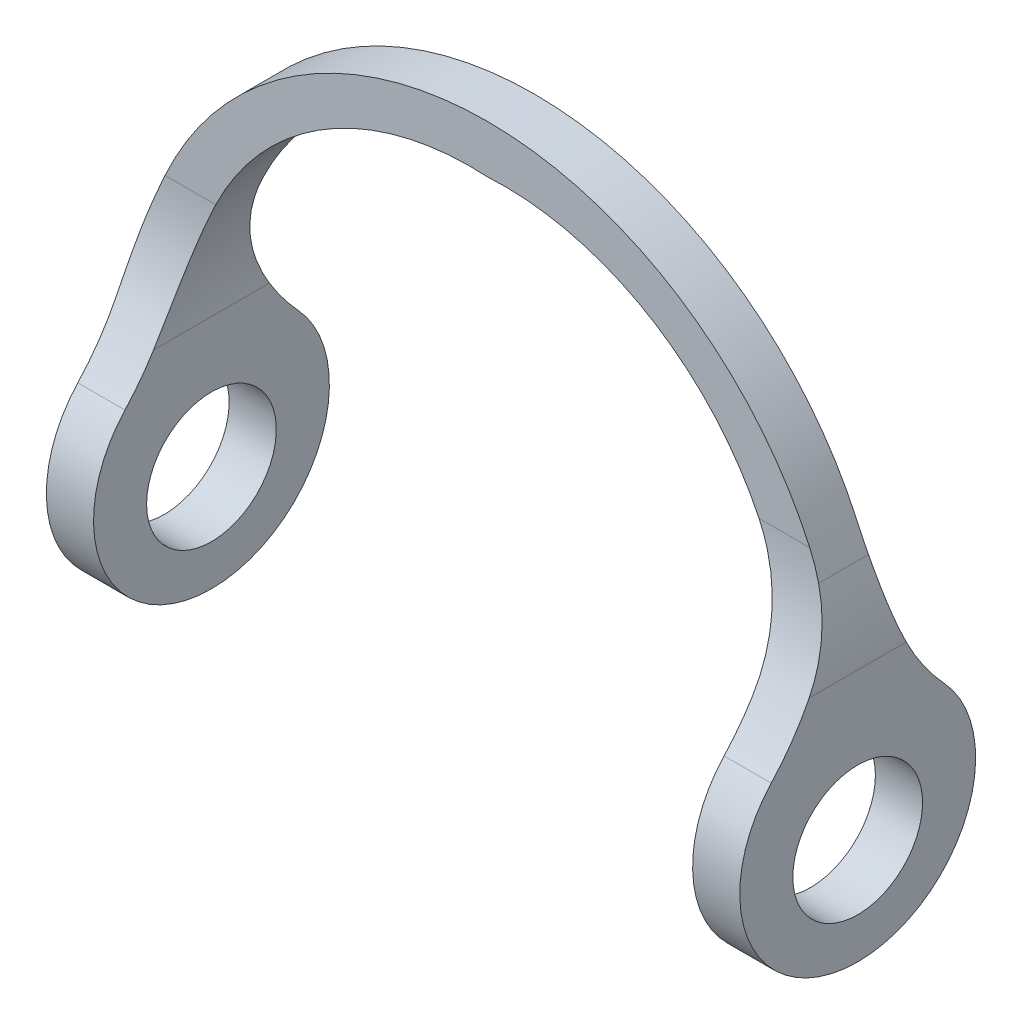
ISO-10303-21;
HEADER;
FILE_DESCRIPTION(('STEP AP214'),'2;1');
FILE_NAME('part.step','',(''),(''),'','','');
FILE_SCHEMA(('AUTOMOTIVE_DESIGN { 1 0 10303 214 1 1 1 1 }'));
ENDSEC;
DATA;
#1=APPLICATION_CONTEXT('core data for automotive mechanical design processes');
#2=APPLICATION_PROTOCOL_DEFINITION('international standard','automotive_design',2000,#1);
#3=PRODUCT_CONTEXT('',#1,'mechanical');
#4=PRODUCT('Part','Part','',(#3));
#5=PRODUCT_RELATED_PRODUCT_CATEGORY('part','',(#4));
#6=PRODUCT_DEFINITION_FORMATION('','',#4);
#7=PRODUCT_DEFINITION_CONTEXT('part definition',#1,'design');
#8=PRODUCT_DEFINITION('design','',#6,#7);
#9=PRODUCT_DEFINITION_SHAPE('','',#8);
#10=(LENGTH_UNIT() NAMED_UNIT(*) SI_UNIT(.MILLI.,.METRE.));
#11=(NAMED_UNIT(*) PLANE_ANGLE_UNIT() SI_UNIT($,.RADIAN.));
#12=(NAMED_UNIT(*) SI_UNIT($,.STERADIAN.) SOLID_ANGLE_UNIT());
#13=UNCERTAINTY_MEASURE_WITH_UNIT(LENGTH_MEASURE(1.E-05),#10,'distance_accuracy_value','');
#14=(GEOMETRIC_REPRESENTATION_CONTEXT(3) GLOBAL_UNCERTAINTY_ASSIGNED_CONTEXT((#13)) GLOBAL_UNIT_ASSIGNED_CONTEXT((#10,
#11,#12)) REPRESENTATION_CONTEXT('',''));
#15=CARTESIAN_POINT('',(0.,0.,0.));
#16=DIRECTION('',(0.,0.,1.));
#17=DIRECTION('',(1.,0.,0.));
#18=AXIS2_PLACEMENT_3D('',#15,#16,#17);
#19=CARTESIAN_POINT('',(0.,2.03547175330502,2.));
#20=DIRECTION('',(0.,0.,1.));
#21=DIRECTION('',(1.,0.,0.));
#22=AXIS2_PLACEMENT_3D('',#19,#20,#21);
#23=PLANE('',#22);
#24=CARTESIAN_POINT('',(0.699999999999999,3.02043406462488,2.));
#25=DIRECTION('',(0.,0.,-1.));
#26=DIRECTION('',(1.,0.,0.));
#27=AXIS2_PLACEMENT_3D('',#24,#25,#26);
#28=CIRCLE('',#27,12.);
#29=CARTESIAN_POINT('',(0.,15.,2.));
#30=VERTEX_POINT('',#29);
#31=CARTESIAN_POINT('',(11.515747328403,8.21847309181044,2.));
#32=VERTEX_POINT('',#31);
#33=EDGE_CURVE('E156',#30,#32,#28,.T.);
#34=ORIENTED_EDGE('',*,*,#33,.T.);
#35=DIRECTION('',(1.,0.,0.));
#36=VECTOR('',#35,1.);
#37=CARTESIAN_POINT('',(0.,8.21847309181044,2.));
#38=LINE('',#37,#36);
#39=CARTESIAN_POINT('',(13.6664002007859,8.21847309181044,2.));
#40=VERTEX_POINT('',#39);
#41=EDGE_CURVE('E334',#32,#40,#38,.T.);
#42=ORIENTED_EDGE('',*,*,#41,.T.);
#43=CARTESIAN_POINT('',(0.,2.03547175330502,2.));
#44=DIRECTION('',(0.,0.,1.));
#45=DIRECTION('',(1.,0.,0.));
#46=AXIS2_PLACEMENT_3D('',#43,#44,#45);
#47=CIRCLE('',#46,15.);
#48=CARTESIAN_POINT('',(-13.6664002007859,8.21847309181044,2.));
#49=VERTEX_POINT('',#48);
#50=EDGE_CURVE('E176',#40,#49,#47,.T.);
#51=ORIENTED_EDGE('',*,*,#50,.T.);
#52=DIRECTION('',(1.,0.,0.));
#53=VECTOR('',#52,1.);
#54=CARTESIAN_POINT('',(-12.7,8.21847309181044,2.));
#55=LINE('',#54,#53);
#56=CARTESIAN_POINT('',(-11.515747328403,8.21847309181044,2.));
#57=VERTEX_POINT('',#56);
#58=EDGE_CURVE('E159',#49,#57,#55,.T.);
#59=ORIENTED_EDGE('',*,*,#58,.T.);
#60=CARTESIAN_POINT('',(-0.699999999999999,3.02043406462488,2.));
#61=DIRECTION('',(0.,0.,-1.));
#62=DIRECTION('',(-1.,0.,0.));
#63=AXIS2_PLACEMENT_3D('',#60,#61,#62);
#64=CIRCLE('',#63,12.);
#65=EDGE_CURVE('E152',#57,#30,#64,.T.);
#66=ORIENTED_EDGE('',*,*,#65,.T.);
#67=EDGE_LOOP('',(#34,#42,#51,#59,#66));
#68=FACE_BOUND('',#67,.T.);
#69=ADVANCED_FACE('F40',(#68),#23,.T.);
#70=CARTESIAN_POINT('',(0.,2.03547175330502,0.));
#71=DIRECTION('',(0.,0.,1.));
#72=DIRECTION('',(1.,0.,0.));
#73=AXIS2_PLACEMENT_3D('',#70,#71,#72);
#74=PLANE('',#73);
#75=CARTESIAN_POINT('',(0.,2.03547175330502,0.));
#76=DIRECTION('',(0.,0.,1.));
#77=DIRECTION('',(1.,0.,0.));
#78=AXIS2_PLACEMENT_3D('',#75,#76,#77);
#79=CIRCLE('',#78,15.);
#80=CARTESIAN_POINT('',(13.6664002007859,8.21847309181044,0.));
#81=VERTEX_POINT('',#80);
#82=CARTESIAN_POINT('',(-13.6664002007859,8.21847309181044,0.));
#83=VERTEX_POINT('',#82);
#84=EDGE_CURVE('E163',#81,#83,#79,.T.);
#85=ORIENTED_EDGE('',*,*,#84,.F.);
#86=DIRECTION('',(-1.,0.,0.));
#87=VECTOR('',#86,1.);
#88=CARTESIAN_POINT('',(12.7,8.21847309181044,0.));
#89=LINE('',#88,#87);
#90=CARTESIAN_POINT('',(11.515747328403,8.21847309181044,0.));
#91=VERTEX_POINT('',#90);
#92=EDGE_CURVE('E338',#81,#91,#89,.T.);
#93=ORIENTED_EDGE('',*,*,#92,.T.);
#94=CARTESIAN_POINT('',(0.699999999999999,3.02043406462488,0.));
#95=DIRECTION('',(0.,0.,-1.));
#96=DIRECTION('',(1.,0.,0.));
#97=AXIS2_PLACEMENT_3D('',#94,#95,#96);
#98=CIRCLE('',#97,12.);
#99=CARTESIAN_POINT('',(0.,15.,0.));
#100=VERTEX_POINT('',#99);
#101=EDGE_CURVE('E182',#100,#91,#98,.T.);
#102=ORIENTED_EDGE('',*,*,#101,.F.);
#103=CARTESIAN_POINT('',(-0.699999999999999,3.02043406462488,0.));
#104=DIRECTION('',(0.,0.,-1.));
#105=DIRECTION('',(-1.,0.,0.));
#106=AXIS2_PLACEMENT_3D('',#103,#104,#105);
#107=CIRCLE('',#106,12.);
#108=CARTESIAN_POINT('',(-11.515747328403,8.21847309181044,0.));
#109=VERTEX_POINT('',#108);
#110=EDGE_CURVE('E169',#109,#100,#107,.T.);
#111=ORIENTED_EDGE('',*,*,#110,.F.);
#112=DIRECTION('',(-1.,0.,0.));
#113=VECTOR('',#112,1.);
#114=CARTESIAN_POINT('',(0.,8.21847309181044,0.));
#115=LINE('',#114,#113);
#116=EDGE_CURVE('E188',#109,#83,#115,.T.);
#117=ORIENTED_EDGE('',*,*,#116,.T.);
#118=EDGE_LOOP('',(#85,#93,#102,#111,#117));
#119=FACE_BOUND('',#118,.T.);
#120=ADVANCED_FACE('F369',(#119),#74,.F.);
#121=CARTESIAN_POINT('',(-12.7,0.,2.));
#122=DIRECTION('',(-1.,0.,0.));
#123=DIRECTION('',(0.,0.,1.));
#124=AXIS2_PLACEMENT_3D('',#121,#122,#123);
#125=PLANE('',#124);
#126=CARTESIAN_POINT('',(-12.7,-2.49839989758689,1.));
#127=DIRECTION('',(-1.,0.,0.));
#128=DIRECTION('',(0.,0.,1.));
#129=AXIS2_PLACEMENT_3D('',#126,#127,#128);
#130=CIRCLE('',#129,2.74999999999999);
#131=CARTESIAN_POINT('',(-12.7,-2.49839989758689,3.74999999999999));
#132=VERTEX_POINT('',#131);
#133=EDGE_CURVE('E386',#132,#132,#130,.T.);
#134=ORIENTED_EDGE('',*,*,#133,.T.);
#135=EDGE_LOOP('',(#134));
#136=FACE_BOUND('',#135,.T.);
#137=CARTESIAN_POINT('',(-12.7,-1.97956593537512,1.));
#138=DIRECTION('',(-1.,0.,0.));
#139=DIRECTION('',(0.,-1.,0.));
#140=AXIS2_PLACEMENT_3D('',#137,#138,#139);
#141=CIRCLE('',#140,5.);
#142=CARTESIAN_POINT('',(-12.7,1.41978040702007,-2.66666666666667));
#143=VERTEX_POINT('',#142);
#144=CARTESIAN_POINT('',(-12.7,1.41978040702007,4.66666666666667));
#145=VERTEX_POINT('',#144);
#146=EDGE_CURVE('E183',#143,#145,#141,.T.);
#147=ORIENTED_EDGE('',*,*,#146,.F.);
#148=CARTESIAN_POINT('',(-12.7,8.21847309181044,-10.));
#149=DIRECTION('',(-1.,0.,0.));
#150=DIRECTION('',(0.,0.,1.));
#151=AXIS2_PLACEMENT_3D('',#148,#149,#150);
#152=CIRCLE('',#151,10.);
#153=CARTESIAN_POINT('',(-12.7,3.02043406462488,-1.457143904299));
#154=VERTEX_POINT('',#153);
#155=EDGE_CURVE('E235',#143,#154,#152,.T.);
#156=ORIENTED_EDGE('',*,*,#155,.T.);
#157=DIRECTION('',(0.,0.,-1.));
#158=VECTOR('',#157,1.);
#159=CARTESIAN_POINT('',(-12.7,3.02043406462488,2.));
#160=LINE('',#159,#158);
#161=CARTESIAN_POINT('',(-12.7,3.02043406462488,3.457143904299));
#162=VERTEX_POINT('',#161);
#163=EDGE_CURVE('E172',#162,#154,#160,.T.);
#164=ORIENTED_EDGE('',*,*,#163,.F.);
#165=CARTESIAN_POINT('',(-12.7,8.21847309181044,12.));
#166=DIRECTION('',(-1.,0.,0.));
#167=DIRECTION('',(0.,0.,1.));
#168=AXIS2_PLACEMENT_3D('',#165,#166,#167);
#169=CIRCLE('',#168,10.);
#170=EDGE_CURVE('E249',#162,#145,#169,.T.);
#171=ORIENTED_EDGE('',*,*,#170,.T.);
#172=EDGE_LOOP('',(#147,#156,#164,#171));
#173=FACE_BOUND('',#172,.T.);
#174=ADVANCED_FACE('F220',(#136,#173),#125,.F.);
#175=CARTESIAN_POINT('',(-0.699999999999999,3.02043406462488,2.));
#176=DIRECTION('',(0.,0.,-1.));
#177=DIRECTION('',(-1.,0.,0.));
#178=AXIS2_PLACEMENT_3D('',#175,#176,#177);
#179=CYLINDRICAL_SURFACE('',#178,12.);
#180=ORIENTED_EDGE('',*,*,#163,.T.);
#181=CARTESIAN_POINT('',(-12.7,3.02043406462488,-1.457143904299));
#182=CARTESIAN_POINT('',(-12.7000345778435,3.21853443574602,-1.33655483341176));
#183=CARTESIAN_POINT('',(-12.695095576234,3.4209150814915,-1.22290671671368));
#184=CARTESIAN_POINT('',(-12.6742449604049,3.8326831024508,-1.01009805691823));
#185=CARTESIAN_POINT('',(-12.6583298886297,4.0420726657522,-0.910942090903391));
#186=CARTESIAN_POINT('',(-12.615141034182,4.45997854647559,-0.730477243971254));
#187=CARTESIAN_POINT('',(-12.5882129197032,4.6683414367148,-0.648731356637426));
#188=CARTESIAN_POINT('',(-12.522390924287,5.08833957329437,-0.499901127505256));
#189=CARTESIAN_POINT('',(-12.4834995116785,5.29997413605969,-0.432813766163813));
#190=CARTESIAN_POINT('',(-12.3908016120393,5.7366253379079,-0.310073110924546));
#191=CARTESIAN_POINT('',(-12.3362842417288,5.96173001775461,-0.255266215804449));
#192=CARTESIAN_POINT('',(-12.2132441975972,6.41154153008638,-0.16192120586803));
#193=CARTESIAN_POINT('',(-12.144717106715,6.63624821449619,-0.123388233758687));
#194=CARTESIAN_POINT('',(-11.9913948401141,7.09027328282627,-0.0611216624465499));
#195=CARTESIAN_POINT('',(-11.9061518422991,7.31951125347469,-0.0378973515397613));
#196=CARTESIAN_POINT('',(-11.7676255143199,7.65968870937816,-0.0149763184838044));
#197=CARTESIAN_POINT('',(-11.7196762045307,7.77246148020044,-0.00932186209142292));
#198=CARTESIAN_POINT('',(-11.6203012163315,7.99658174884477,-0.00183360791003926));
#199=CARTESIAN_POINT('',(-11.5688758577893,8.10792937669071,5.40932748335715E-07));
#200=CARTESIAN_POINT('',(-11.515747328403,8.21847309181044,0.));
#201=B_SPLINE_CURVE_WITH_KNOTS('',3,(#181,#182,#183,#184,#185,#186,#187,#188,#189,#190,#191,
#192,#193,#194,#195,#196,#197,#198,#199,#200),.UNSPECIFIED.,.F.,.F.,(4,2,2,2,2,2,2,2,2,4),(0.,
0.695628767827362,1.39147676479211,2.06698199074259,2.74234793637648,3.45538116475767,
4.16863954980144,4.90456723567072,5.27248820110503,5.64037535623867),.UNSPECIFIED.);
#202=EDGE_CURVE('E228',#154,#109,#201,.T.);
#203=ORIENTED_EDGE('',*,*,#202,.T.);
#204=ORIENTED_EDGE('',*,*,#110,.T.);
#205=DIRECTION('',(0.,0.,-1.));
#206=VECTOR('',#205,1.);
#207=CARTESIAN_POINT('',(0.,15.,2.));
#208=LINE('',#207,#206);
#209=EDGE_CURVE('E166',#30,#100,#208,.T.);
#210=ORIENTED_EDGE('',*,*,#209,.F.);
#211=ORIENTED_EDGE('',*,*,#65,.F.);
#212=CARTESIAN_POINT('',(-11.515747328403,8.21847309181044,2.));
#213=CARTESIAN_POINT('',(-11.5659836421322,8.11394681060843,1.99999954078589));
#214=CARTESIAN_POINT('',(-11.61469765995,8.00870132359967,2.00163933887568));
#215=CARTESIAN_POINT('',(-11.7090217314866,7.79692630323375,2.00832722241847));
#216=CARTESIAN_POINT('',(-11.7546315442132,7.6903966709371,2.01337557215988));
#217=CARTESIAN_POINT('',(-11.886710277143,7.36912301240307,2.03382570243037));
#218=CARTESIAN_POINT('',(-11.9684216099412,7.15270855260126,2.05453259899145));
#219=CARTESIAN_POINT('',(-12.1164858082505,6.72365696963169,2.11005797741569));
#220=CARTESIAN_POINT('',(-12.1832177409972,6.51109429832969,2.14444635412962));
#221=CARTESIAN_POINT('',(-12.3041220504265,6.08528611912045,2.22776582849908));
#222=CARTESIAN_POINT('',(-12.3582970283104,5.87204076192885,2.27669390942142));
#223=CARTESIAN_POINT('',(-12.4568690888977,5.43476913288905,2.39245378393544));
#224=CARTESIAN_POINT('',(-12.5005520164538,5.21080514605742,2.46013215584229));
#225=CARTESIAN_POINT('',(-12.5744771444475,4.76617708942071,2.61187624951954));
#226=CARTESIAN_POINT('',(-12.6047150817195,4.54551408770086,2.69594715693121));
#227=CARTESIAN_POINT('',(-12.6532465118193,4.10259703447453,2.88302943997329));
#228=CARTESIAN_POINT('',(-12.6711296418071,3.88051548749779,2.98655805927667));
#229=CARTESIAN_POINT('',(-12.6886625829284,3.55327924010282,3.15404018586293));
#230=CARTESIAN_POINT('',(-12.6929582917133,3.44518774500927,3.21189529823609));
#231=CARTESIAN_POINT('',(-12.6986271533783,3.23115487782054,3.33156958938602));
#232=CARTESIAN_POINT('',(-12.7000005521804,3.12521332554381,3.39338843415061));
#233=CARTESIAN_POINT('',(-12.7,3.02043406462488,3.457143904299));
#234=B_SPLINE_CURVE_WITH_KNOTS('',3,(#212,#213,#214,#215,#216,#217,#218,#219,#220,#221,#222,
#223,#224,#225,#226,#227,#228,#229,#230,#231,#232,#233),.UNSPECIFIED.,.F.,.F.,(4,2,2,2,2,2,2,2,
2,2,4),(0.,0.347866798603145,0.69576057280481,1.39159565770399,2.06709458551366,
2.74245345690328,3.45549168603311,4.16875584586153,4.90469932143269,5.27262737995133,
5.64052447488873),.UNSPECIFIED.);
#235=EDGE_CURVE('E243',#57,#162,#234,.T.);
#236=ORIENTED_EDGE('',*,*,#235,.T.);
#237=EDGE_LOOP('',(#180,#203,#204,#210,#211,#236));
#238=FACE_BOUND('',#237,.T.);
#239=ADVANCED_FACE('F167',(#238),#179,.F.);
#240=CARTESIAN_POINT('',(0.699999999999999,3.02043406462488,2.));
#241=DIRECTION('',(0.,0.,-1.));
#242=DIRECTION('',(-1.,0.,0.));
#243=AXIS2_PLACEMENT_3D('',#240,#241,#242);
#244=CYLINDRICAL_SURFACE('',#243,12.);
#245=ORIENTED_EDGE('',*,*,#101,.T.);
#246=CARTESIAN_POINT('',(11.515747328403,8.21847309181044,0.));
#247=CARTESIAN_POINT('',(11.5659836421322,8.11394681060843,4.59214108682988E-07));
#248=CARTESIAN_POINT('',(11.61469765995,8.00870132359967,-0.00163933887568005));
#249=CARTESIAN_POINT('',(11.7090217314866,7.79692630323375,-0.00832722241846896));
#250=CARTESIAN_POINT('',(11.7546315442132,7.6903966709371,-0.0133755721598741));
#251=CARTESIAN_POINT('',(11.886710277143,7.36912301240307,-0.0338257024303649));
#252=CARTESIAN_POINT('',(11.9684216099412,7.15270855260126,-0.0545325989914497));
#253=CARTESIAN_POINT('',(12.1164858082505,6.72365696963169,-0.110057977415686));
#254=CARTESIAN_POINT('',(12.1832177409972,6.51109429832969,-0.144446354129625));
#255=CARTESIAN_POINT('',(12.3041220504265,6.08528611912045,-0.227765828499087));
#256=CARTESIAN_POINT('',(12.3582970283104,5.87204076192885,-0.276693909421419));
#257=CARTESIAN_POINT('',(12.4568690888977,5.43476913288905,-0.392453783935436));
#258=CARTESIAN_POINT('',(12.5005520164538,5.21080514605742,-0.460132155842291));
#259=CARTESIAN_POINT('',(12.5744771444475,4.76617708942071,-0.61187624951954));
#260=CARTESIAN_POINT('',(12.6047150817195,4.54551408770086,-0.695947156931209));
#261=CARTESIAN_POINT('',(12.6532465118193,4.10259703447453,-0.883029439973287));
#262=CARTESIAN_POINT('',(12.6711296418071,3.88051548749779,-0.986558059276668));
#263=CARTESIAN_POINT('',(12.6886625829284,3.55327924010282,-1.15404018586293));
#264=CARTESIAN_POINT('',(12.6929582917133,3.44518774500927,-1.21189529823609));
#265=CARTESIAN_POINT('',(12.6986271533783,3.23115487782054,-1.33156958938602));
#266=CARTESIAN_POINT('',(12.7000005521804,3.12521332554381,-1.39338843415061));
#267=CARTESIAN_POINT('',(12.7,3.02043406462488,-1.457143904299));
#268=B_SPLINE_CURVE_WITH_KNOTS('',3,(#246,#247,#248,#249,#250,#251,#252,#253,#254,#255,#256,
#257,#258,#259,#260,#261,#262,#263,#264,#265,#266,#267),.UNSPECIFIED.,.F.,.F.,(4,2,2,2,2,2,2,2,
2,2,4),(0.,0.347866798603145,0.69576057280481,1.39159565770399,2.06709458551366,
2.74245345690328,3.45549168603311,4.16875584586154,4.90469932143269,5.27262737995133,
5.64052447488873),.UNSPECIFIED.);
#269=CARTESIAN_POINT('',(12.7,3.02043406462488,-1.457143904299));
#270=VERTEX_POINT('',#269);
#271=EDGE_CURVE('E304',#91,#270,#268,.T.);
#272=ORIENTED_EDGE('',*,*,#271,.T.);
#273=DIRECTION('',(0.,0.,-1.));
#274=VECTOR('',#273,1.);
#275=CARTESIAN_POINT('',(12.7,3.02043406462488,2.));
#276=LINE('',#275,#274);
#277=CARTESIAN_POINT('',(12.7,3.02043406462488,3.457143904299));
#278=VERTEX_POINT('',#277);
#279=EDGE_CURVE('E60',#278,#270,#276,.T.);
#280=ORIENTED_EDGE('',*,*,#279,.F.);
#281=CARTESIAN_POINT('',(12.7,3.02043406462488,3.457143904299));
#282=CARTESIAN_POINT('',(12.7000345778435,3.21853443574602,3.33655483341177));
#283=CARTESIAN_POINT('',(12.695095576234,3.4209150814915,3.22290671671368));
#284=CARTESIAN_POINT('',(12.6742449604049,3.8326831024508,3.01009805691823));
#285=CARTESIAN_POINT('',(12.6583298886297,4.0420726657522,2.91094209090339));
#286=CARTESIAN_POINT('',(12.615141034182,4.45997854647559,2.73047724397126));
#287=CARTESIAN_POINT('',(12.5882129197032,4.6683414367148,2.64873135663743));
#288=CARTESIAN_POINT('',(12.522390924287,5.08833957329437,2.49990112750526));
#289=CARTESIAN_POINT('',(12.4834995116785,5.29997413605969,2.43281376616382));
#290=CARTESIAN_POINT('',(12.3908016120393,5.73662533790789,2.31007311092455));
#291=CARTESIAN_POINT('',(12.3362842417288,5.96173001775461,2.25526621580445));
#292=CARTESIAN_POINT('',(12.2132441975972,6.41154153008638,2.16192120586803));
#293=CARTESIAN_POINT('',(12.144717106715,6.63624821449619,2.12338823375869));
#294=CARTESIAN_POINT('',(11.9913948401141,7.09027328282628,2.06112166244655));
#295=CARTESIAN_POINT('',(11.9061518422991,7.31951125347469,2.03789735153976));
#296=CARTESIAN_POINT('',(11.7676255143199,7.65968870937816,2.0149763184838));
#297=CARTESIAN_POINT('',(11.7196762045307,7.77246148020044,2.00932186209142));
#298=CARTESIAN_POINT('',(11.6203012163315,7.99658174884477,2.00183360791004));
#299=CARTESIAN_POINT('',(11.5688758577893,8.10792937669071,1.99999945906725));
#300=CARTESIAN_POINT('',(11.515747328403,8.21847309181044,2.));
#301=B_SPLINE_CURVE_WITH_KNOTS('',3,(#281,#282,#283,#284,#285,#286,#287,#288,#289,#290,#291,
#292,#293,#294,#295,#296,#297,#298,#299,#300),.UNSPECIFIED.,.F.,.F.,(4,2,2,2,2,2,2,2,2,4),(0.,
0.695628767827363,1.39147676479211,2.06698199074259,2.74234793637648,3.45538116475767,
4.16863954980144,4.90456723567073,5.27248820110503,5.64037535623868),.UNSPECIFIED.);
#302=EDGE_CURVE('E11',#278,#32,#301,.T.);
#303=ORIENTED_EDGE('',*,*,#302,.T.);
#304=ORIENTED_EDGE('',*,*,#33,.F.);
#305=ORIENTED_EDGE('',*,*,#209,.T.);
#306=EDGE_LOOP('',(#245,#272,#280,#303,#304,#305));
#307=FACE_BOUND('',#306,.T.);
#308=ADVANCED_FACE('F174',(#307),#244,.F.);
#309=CARTESIAN_POINT('',(12.7,0.,2.));
#310=DIRECTION('',(1.,0.,0.));
#311=DIRECTION('',(0.,0.,-1.));
#312=AXIS2_PLACEMENT_3D('',#309,#310,#311);
#313=PLANE('',#312);
#314=CARTESIAN_POINT('',(12.7,-2.49839989758689,1.));
#315=DIRECTION('',(1.,0.,0.));
#316=DIRECTION('',(0.,0.,-1.));
#317=AXIS2_PLACEMENT_3D('',#314,#315,#316);
#318=CIRCLE('',#317,2.74999999999999);
#319=CARTESIAN_POINT('',(12.7,-2.49839989758689,-1.74999999999999));
#320=VERTEX_POINT('',#319);
#321=EDGE_CURVE('E390',#320,#320,#318,.T.);
#322=ORIENTED_EDGE('',*,*,#321,.T.);
#323=EDGE_LOOP('',(#322));
#324=FACE_BOUND('',#323,.T.);
#325=ORIENTED_EDGE('',*,*,#279,.T.);
#326=CARTESIAN_POINT('',(12.7,8.21847309181044,-10.));
#327=DIRECTION('',(1.,0.,0.));
#328=DIRECTION('',(0.,0.,-1.));
#329=AXIS2_PLACEMENT_3D('',#326,#327,#328);
#330=CIRCLE('',#329,10.);
#331=CARTESIAN_POINT('',(12.7,1.41978040702007,-2.66666666666667));
#332=VERTEX_POINT('',#331);
#333=EDGE_CURVE('E310',#270,#332,#330,.T.);
#334=ORIENTED_EDGE('',*,*,#333,.T.);
#335=CARTESIAN_POINT('',(12.7,-1.97956593537512,1.));
#336=DIRECTION('',(-1.,0.,0.));
#337=DIRECTION('',(0.,-1.,0.));
#338=AXIS2_PLACEMENT_3D('',#335,#336,#337);
#339=CIRCLE('',#338,5.);
#340=CARTESIAN_POINT('',(12.7,1.41978040702007,4.66666666666667));
#341=VERTEX_POINT('',#340);
#342=EDGE_CURVE('E331',#332,#341,#339,.T.);
#343=ORIENTED_EDGE('',*,*,#342,.T.);
#344=CARTESIAN_POINT('',(12.7,8.21847309181044,12.));
#345=DIRECTION('',(1.,0.,0.));
#346=DIRECTION('',(0.,0.,-1.));
#347=AXIS2_PLACEMENT_3D('',#344,#345,#346);
#348=CIRCLE('',#347,10.);
#349=EDGE_CURVE('E54',#341,#278,#348,.T.);
#350=ORIENTED_EDGE('',*,*,#349,.T.);
#351=EDGE_LOOP('',(#325,#334,#343,#350));
#352=FACE_BOUND('',#351,.T.);
#353=ADVANCED_FACE('F329',(#324,#352),#313,.F.);
#354=CARTESIAN_POINT('',(14.7,5.02043406462488,2.));
#355=DIRECTION('',(-1.,0.,0.));
#356=DIRECTION('',(0.,-1.,0.));
#357=AXIS2_PLACEMENT_3D('',#354,#355,#356);
#358=PLANE('',#357);
#359=CARTESIAN_POINT('',(14.7,-2.49839989758689,1.));
#360=DIRECTION('',(-1.,0.,0.));
#361=DIRECTION('',(0.,0.,1.));
#362=AXIS2_PLACEMENT_3D('',#359,#360,#361);
#363=CIRCLE('',#362,2.75);
#364=CARTESIAN_POINT('',(14.7,-2.49839989758689,3.75));
#365=VERTEX_POINT('',#364);
#366=EDGE_CURVE('E393',#365,#365,#363,.T.);
#367=ORIENTED_EDGE('',*,*,#366,.T.);
#368=EDGE_LOOP('',(#367));
#369=FACE_BOUND('',#368,.T.);
#370=DIRECTION('',(0.,0.,-1.));
#371=VECTOR('',#370,1.);
#372=CARTESIAN_POINT('',(14.7,3.74134396422821,2.));
#373=LINE('',#372,#371);
#374=CARTESIAN_POINT('',(14.7,3.74134396422821,-1.05822641893932));
#375=VERTEX_POINT('',#374);
#376=CARTESIAN_POINT('',(14.7,3.74134396422821,3.05822641893932));
#377=VERTEX_POINT('',#376);
#378=EDGE_CURVE('E68',#375,#377,#373,.F.);
#379=ORIENTED_EDGE('',*,*,#378,.T.);
#380=CARTESIAN_POINT('',(14.7,8.21847309181045,12.));
#381=DIRECTION('',(-1.,0.,0.));
#382=DIRECTION('',(0.,-1.,0.));
#383=AXIS2_PLACEMENT_3D('',#380,#381,#382);
#384=CIRCLE('',#383,10.);
#385=CARTESIAN_POINT('',(14.7,1.41978040702007,4.66666666666667));
#386=VERTEX_POINT('',#385);
#387=EDGE_CURVE('E325',#377,#386,#384,.T.);
#388=ORIENTED_EDGE('',*,*,#387,.T.);
#389=CARTESIAN_POINT('',(14.7,-1.97956593537512,1.));
#390=DIRECTION('',(-1.,0.,0.));
#391=DIRECTION('',(0.,-1.,0.));
#392=AXIS2_PLACEMENT_3D('',#389,#390,#391);
#393=CIRCLE('',#392,5.);
#394=CARTESIAN_POINT('',(14.7,1.41978040702007,-2.66666666666667));
#395=VERTEX_POINT('',#394);
#396=EDGE_CURVE('E383',#395,#386,#393,.T.);
#397=ORIENTED_EDGE('',*,*,#396,.F.);
#398=CARTESIAN_POINT('',(14.7,8.21847309181045,-10.));
#399=DIRECTION('',(-1.,0.,0.));
#400=DIRECTION('',(0.,-1.,0.));
#401=AXIS2_PLACEMENT_3D('',#398,#399,#400);
#402=CIRCLE('',#401,10.);
#403=EDGE_CURVE('E337',#395,#375,#402,.T.);
#404=ORIENTED_EDGE('',*,*,#403,.T.);
#405=EDGE_LOOP('',(#379,#388,#397,#404));
#406=FACE_BOUND('',#405,.T.);
#407=ADVANCED_FACE('F409',(#369,#406),#358,.F.);
#408=CARTESIAN_POINT('',(0.,2.03547175330502,2.));
#409=DIRECTION('',(0.,0.,-1.));
#410=DIRECTION('',(-1.,0.,0.));
#411=AXIS2_PLACEMENT_3D('',#408,#409,#410);
#412=CYLINDRICAL_SURFACE('',#411,15.);
#413=ORIENTED_EDGE('',*,*,#50,.F.);
#414=CARTESIAN_POINT('',(13.6664002007859,8.21847309181045,2.));
#415=CARTESIAN_POINT('',(13.7060056365184,8.130934593446,1.9999993624424));
#416=CARTESIAN_POINT('',(13.7447689706386,8.04301357436844,2.00114946456565));
#417=CARTESIAN_POINT('',(13.8205401387125,7.86658415170171,2.00580415379934));
#418=CARTESIAN_POINT('',(13.8575496827381,7.77807642038816,2.00930639463504));
#419=CARTESIAN_POINT('',(13.9298212448701,7.60047589319384,2.01871817938719));
#420=CARTESIAN_POINT('',(13.9650832512192,7.51138309338138,2.0246277394972));
#421=CARTESIAN_POINT('',(14.0338658775144,7.33262161747619,2.03890974880995));
#422=CARTESIAN_POINT('',(14.0673847262087,7.24295245578533,2.04728464769141));
#423=CARTESIAN_POINT('',(14.1,7.15308838607461,2.05691418981088));
#424=B_SPLINE_CURVE_WITH_KNOTS('',3,(#414,#415,#416,#417,#418,#419,#420,#421,#422,#423),
.UNSPECIFIED.,.F.,.F.,(4,2,2,2,4),(0.,0.288234002920891,0.576180916609575,0.864129767291792,
1.15236570913793),.UNSPECIFIED.);
#425=CARTESIAN_POINT('',(14.1,7.15308838607461,2.05691418981088));
#426=VERTEX_POINT('',#425);
#427=EDGE_CURVE('E312',#40,#426,#424,.T.);
#428=ORIENTED_EDGE('',*,*,#427,.T.);
#429=DIRECTION('',(0.,0.,-1.));
#430=VECTOR('',#429,1.);
#431=CARTESIAN_POINT('',(14.1,7.15308838607461,2.));
#432=LINE('',#431,#430);
#433=CARTESIAN_POINT('',(14.1,7.15308838607461,-0.0569141898108813));
#434=VERTEX_POINT('',#433);
#435=EDGE_CURVE('E258',#426,#434,#432,.T.);
#436=ORIENTED_EDGE('',*,*,#435,.T.);
#437=CARTESIAN_POINT('',(14.1,7.15308838607461,-0.0569141898108814));
#438=CARTESIAN_POINT('',(14.0673847262087,7.24295245578533,-0.0472846476914104));
#439=CARTESIAN_POINT('',(14.0338658775144,7.33262161747619,-0.0389097488099516));
#440=CARTESIAN_POINT('',(13.9650832512192,7.51138309338138,-0.0246277394971949));
#441=CARTESIAN_POINT('',(13.9298212448701,7.60047589319384,-0.0187181793871933));
#442=CARTESIAN_POINT('',(13.8575496827381,7.77807642038816,-0.00930639463504396));
#443=CARTESIAN_POINT('',(13.8205401387125,7.86658415170171,-0.00580415379933873));
#444=CARTESIAN_POINT('',(13.7447689706386,8.04301357436844,-0.00114946456564768));
#445=CARTESIAN_POINT('',(13.7060056365184,8.130934593446,6.37557606745694E-07));
#446=CARTESIAN_POINT('',(13.6664002007859,8.21847309181044,0.));
#447=B_SPLINE_CURVE_WITH_KNOTS('',3,(#437,#438,#439,#440,#441,#442,#443,#444,#445,#446),
.UNSPECIFIED.,.F.,.F.,(4,2,2,2,4),(0.,0.288235941846135,0.576184792528352,0.864131706217033,
1.15236570913793),.UNSPECIFIED.);
#448=EDGE_CURVE('E299',#434,#81,#447,.T.);
#449=ORIENTED_EDGE('',*,*,#448,.T.);
#450=ORIENTED_EDGE('',*,*,#84,.T.);
#451=CARTESIAN_POINT('',(-13.6664002007859,8.21847309181045,0.));
#452=CARTESIAN_POINT('',(-13.7254724001873,8.08791053332238,1.11939021387767E-06));
#453=CARTESIAN_POINT('',(-13.7826627809716,7.95651210433848,-0.00255768292628312));
#454=CARTESIAN_POINT('',(-13.8931927711796,7.6922990580662,-0.0129772707093121));
#455=CARTESIAN_POINT('',(-13.9465319947934,7.55948430041514,-0.0208385865691857));
#456=CARTESIAN_POINT('',(-14.0996249197641,7.16193546890464,-0.0524423713661449));
#457=CARTESIAN_POINT('',(-14.1936070392299,6.89554374842217,-0.0841986106806939));
#458=CARTESIAN_POINT('',(-14.3654876502757,6.36115560703104,-0.170269486941904));
#459=CARTESIAN_POINT('',(-14.4433843168288,6.09315900758127,-0.224586681511429));
#460=CARTESIAN_POINT('',(-14.548405735519,5.69106654471388,-0.323660323370571));
#461=CARTESIAN_POINT('',(-14.5815733373709,5.55636873745008,-0.359835878556576));
#462=CARTESIAN_POINT('',(-14.6438311940525,5.28773724884417,-0.438077294016373));
#463=CARTESIAN_POINT('',(-14.6729212702977,5.15380360121647,-0.480143412119674));
#464=CARTESIAN_POINT('',(-14.7,5.0204340646249,-0.525162461519555));
#465=B_SPLINE_CURVE_WITH_KNOTS('',3,(#451,#452,#453,#454,#455,#456,#457,#458,#459,#460,#461,
#462,#463,#464),.UNSPECIFIED.,.F.,.F.,(4,2,2,2,2,2,4),(0.,0.429843094177524,0.859729190551895,
1.71113117316004,2.5626297013152,2.99255189471942,3.42249291167191),.UNSPECIFIED.);
#466=CARTESIAN_POINT('',(-14.1,7.15308838607466,-0.0569141898108778));
#467=VERTEX_POINT('',#466);
#468=EDGE_CURVE('E197',#83,#467,#465,.T.);
#469=ORIENTED_EDGE('',*,*,#468,.T.);
#470=DIRECTION('',(0.,0.,-1.));
#471=VECTOR('',#470,1.);
#472=CARTESIAN_POINT('',(-14.1,7.15308838607466,2.));
#473=LINE('',#472,#471);
#474=CARTESIAN_POINT('',(-14.1,7.15308838607465,2.05691418981088));
#475=VERTEX_POINT('',#474);
#476=EDGE_CURVE('E256',#467,#475,#473,.F.);
#477=ORIENTED_EDGE('',*,*,#476,.T.);
#478=CARTESIAN_POINT('',(-14.7,5.0204340646249,2.52516246151948));
#479=CARTESIAN_POINT('',(-14.6729212702977,5.15380360121648,2.48014341211965));
#480=CARTESIAN_POINT('',(-14.6438311940525,5.28773724884418,2.43807729401636));
#481=CARTESIAN_POINT('',(-14.5815733373709,5.55636873745009,2.35983587855658));
#482=CARTESIAN_POINT('',(-14.548405735519,5.69106654471389,2.32366032337057));
#483=CARTESIAN_POINT('',(-14.4433843168288,6.09315900758128,2.22458668151142));
#484=CARTESIAN_POINT('',(-14.3654876502757,6.36115560703104,2.17026948694191));
#485=CARTESIAN_POINT('',(-14.1936070392299,6.89554374842217,2.0841986106807));
#486=CARTESIAN_POINT('',(-14.0996249197641,7.16193546890464,2.05244237136615));
#487=CARTESIAN_POINT('',(-13.9465319947934,7.55948430041514,2.02083858656919));
#488=CARTESIAN_POINT('',(-13.8931927711796,7.6922990580662,2.01297727070931));
#489=CARTESIAN_POINT('',(-13.7826627809716,7.95651210433848,2.00255768292628));
#490=CARTESIAN_POINT('',(-13.7254724001873,8.08791053332238,1.99999888060979));
#491=CARTESIAN_POINT('',(-13.6664002007859,8.21847309181044,2.));
#492=B_SPLINE_CURVE_WITH_KNOTS('',3,(#478,#479,#480,#481,#482,#483,#484,#485,#486,#487,#488,
#489,#490,#491),.UNSPECIFIED.,.F.,.F.,(4,2,2,2,2,2,4),(0.,0.42994101695248,0.859863210356691,
1.71136173851185,2.56276372111999,2.99264981749436,3.42249291167188),.UNSPECIFIED.);
#493=EDGE_CURVE('E250',#475,#49,#492,.T.);
#494=ORIENTED_EDGE('',*,*,#493,.T.);
#495=EDGE_LOOP('',(#413,#428,#436,#449,#450,#469,#477,#494));
#496=FACE_BOUND('',#495,.T.);
#497=ADVANCED_FACE('F208',(#496),#412,.T.);
#498=CARTESIAN_POINT('',(-14.7,-1.97956593537512,2.));
#499=DIRECTION('',(1.,0.,0.));
#500=DIRECTION('',(0.,1.,0.));
#501=AXIS2_PLACEMENT_3D('',#498,#499,#500);
#502=PLANE('',#501);
#503=CARTESIAN_POINT('',(-14.7,-2.49839989758689,1.));
#504=DIRECTION('',(-1.,0.,0.));
#505=DIRECTION('',(0.,0.,1.));
#506=AXIS2_PLACEMENT_3D('',#503,#504,#505);
#507=CIRCLE('',#506,2.74999999999999);
#508=CARTESIAN_POINT('',(-14.7,-2.49839989758689,3.74999999999999));
#509=VERTEX_POINT('',#508);
#510=EDGE_CURVE('E396',#509,#509,#507,.T.);
#511=ORIENTED_EDGE('',*,*,#510,.F.);
#512=EDGE_LOOP('',(#511));
#513=FACE_BOUND('',#512,.T.);
#514=CARTESIAN_POINT('',(-14.7,8.21847309181045,12.));
#515=DIRECTION('',(1.,0.,0.));
#516=DIRECTION('',(0.,1.,0.));
#517=AXIS2_PLACEMENT_3D('',#514,#515,#516);
#518=CIRCLE('',#517,10.);
#519=CARTESIAN_POINT('',(-14.7,1.41978040702007,4.66666666666667));
#520=VERTEX_POINT('',#519);
#521=CARTESIAN_POINT('',(-14.7,3.74134396422824,3.05822641893931));
#522=VERTEX_POINT('',#521);
#523=EDGE_CURVE('E234',#520,#522,#518,.T.);
#524=ORIENTED_EDGE('',*,*,#523,.T.);
#525=DIRECTION('',(0.,0.,-1.));
#526=VECTOR('',#525,1.);
#527=CARTESIAN_POINT('',(-14.7,3.74134396422824,2.));
#528=LINE('',#527,#526);
#529=CARTESIAN_POINT('',(-14.7,3.74134396422824,-1.05822641893931));
#530=VERTEX_POINT('',#529);
#531=EDGE_CURVE('E261',#522,#530,#528,.T.);
#532=ORIENTED_EDGE('',*,*,#531,.T.);
#533=CARTESIAN_POINT('',(-14.7,8.21847309181045,-10.));
#534=DIRECTION('',(1.,0.,0.));
#535=DIRECTION('',(0.,1.,0.));
#536=AXIS2_PLACEMENT_3D('',#533,#534,#535);
#537=CIRCLE('',#536,10.);
#538=CARTESIAN_POINT('',(-14.7,1.41978040702007,-2.66666666666667));
#539=VERTEX_POINT('',#538);
#540=EDGE_CURVE('E206',#530,#539,#537,.T.);
#541=ORIENTED_EDGE('',*,*,#540,.T.);
#542=CARTESIAN_POINT('',(-14.7,-1.97956593537512,1.));
#543=DIRECTION('',(-1.,0.,0.));
#544=DIRECTION('',(0.,-1.,0.));
#545=AXIS2_PLACEMENT_3D('',#542,#543,#544);
#546=CIRCLE('',#545,5.);
#547=EDGE_CURVE('E360',#539,#520,#546,.T.);
#548=ORIENTED_EDGE('',*,*,#547,.T.);
#549=EDGE_LOOP('',(#524,#532,#541,#548));
#550=FACE_BOUND('',#549,.T.);
#551=ADVANCED_FACE('F357',(#513,#550),#502,.F.);
#552=CARTESIAN_POINT('',(-12.7,-1.97956593537512,1.));
#553=DIRECTION('',(-1.,0.,0.));
#554=DIRECTION('',(0.,-1.,0.));
#555=AXIS2_PLACEMENT_3D('',#552,#553,#554);
#556=CYLINDRICAL_SURFACE('',#555,5.);
#557=ORIENTED_EDGE('',*,*,#547,.F.);
#558=DIRECTION('',(-1.,0.,0.));
#559=VECTOR('',#558,1.);
#560=CARTESIAN_POINT('',(-12.7,1.41978040702007,-2.66666666666667));
#561=LINE('',#560,#559);
#562=EDGE_CURVE('E194',#539,#143,#561,.F.);
#563=ORIENTED_EDGE('',*,*,#562,.T.);
#564=ORIENTED_EDGE('',*,*,#146,.T.);
#565=DIRECTION('',(-1.,0.,0.));
#566=VECTOR('',#565,1.);
#567=CARTESIAN_POINT('',(-12.7,1.41978040702007,4.66666666666667));
#568=LINE('',#567,#566);
#569=EDGE_CURVE('E191',#145,#520,#568,.T.);
#570=ORIENTED_EDGE('',*,*,#569,.T.);
#571=EDGE_LOOP('',(#557,#563,#564,#570));
#572=FACE_BOUND('',#571,.T.);
#573=ADVANCED_FACE('F218',(#572),#556,.T.);
#574=CARTESIAN_POINT('',(-12.7,8.21847309181044,-10.));
#575=DIRECTION('',(-1.,0.,0.));
#576=DIRECTION('',(0.,-1.,0.));
#577=AXIS2_PLACEMENT_3D('',#574,#575,#576);
#578=CYLINDRICAL_SURFACE('',#577,10.);
#579=ORIENTED_EDGE('',*,*,#540,.F.);
#580=CARTESIAN_POINT('',(-14.7,3.74134396422824,-1.05822641893931));
#581=CARTESIAN_POINT('',(-14.7000347593637,3.92898732117581,-0.964227728159106));
#582=CARTESIAN_POINT('',(-14.6947193394539,4.11966390891696,-0.876189378766839));
#583=CARTESIAN_POINT('',(-14.6726099977533,4.50572213714649,-0.712413934725036));
#584=CARTESIAN_POINT('',(-14.6558085263362,4.70110679064374,-0.636684971415654));
#585=CARTESIAN_POINT('',(-14.6104222421553,5.09088629437768,-0.499470912991875));
#586=CARTESIAN_POINT('',(-14.582088933478,5.2852176913183,-0.437723072125551));
#587=CARTESIAN_POINT('',(-14.5132322531338,5.67515961116362,-0.326705885764978));
#588=CARTESIAN_POINT('',(-14.4727161835095,5.87076929937874,-0.277429097925729));
#589=CARTESIAN_POINT('',(-14.3826382241734,6.24758490646039,-0.194386720869532));
#590=CARTESIAN_POINT('',(-14.3339430907062,6.42880881992772,-0.159756719476933));
#591=CARTESIAN_POINT('',(-14.2253716774282,6.7915323070166,-0.100601487809271));
#592=CARTESIAN_POINT('',(-14.1653906003019,6.97301720977728,-0.0761785034149123));
#593=CARTESIAN_POINT('',(-14.1,7.15308838607465,-0.0569141898108755));
#594=B_SPLINE_CURVE_WITH_KNOTS('',3,(#580,#581,#582,#583,#584,#585,#586,#587,#588,#589,#590,
#591,#592,#593),.UNSPECIFIED.,.F.,.F.,(4,2,2,2,2,2,4),(0.,0.629504571597282,1.25942330635889,
1.87628305473387,2.49277380729854,3.06465281658538,3.64213057919026),.UNSPECIFIED.);
#595=EDGE_CURVE('E263',#530,#467,#594,.T.);
#596=ORIENTED_EDGE('',*,*,#595,.T.);
#597=ORIENTED_EDGE('',*,*,#468,.F.);
#598=ORIENTED_EDGE('',*,*,#116,.F.);
#599=ORIENTED_EDGE('',*,*,#202,.F.);
#600=ORIENTED_EDGE('',*,*,#155,.F.);
#601=ORIENTED_EDGE('',*,*,#562,.F.);
#602=EDGE_LOOP('',(#579,#596,#597,#598,#599,#600,#601));
#603=FACE_BOUND('',#602,.T.);
#604=ADVANCED_FACE('F212',(#603),#578,.F.);
#605=CARTESIAN_POINT('',(-12.7,8.21847309181044,12.));
#606=DIRECTION('',(-1.,0.,0.));
#607=DIRECTION('',(0.,-1.,0.));
#608=AXIS2_PLACEMENT_3D('',#605,#606,#607);
#609=CYLINDRICAL_SURFACE('',#608,10.);
#610=ORIENTED_EDGE('',*,*,#493,.F.);
#611=CARTESIAN_POINT('',(-14.1,7.15308838607465,2.05691418981088));
#612=CARTESIAN_POINT('',(-14.1356284787101,7.05492860465948,2.06743086713918));
#613=CARTESIAN_POINT('',(-14.1696605070421,6.95636483558235,2.07946351304754));
#614=CARTESIAN_POINT('',(-14.2345134455696,6.75860777658765,2.10663076706753));
#615=CARTESIAN_POINT('',(-14.2653342729183,6.65941447049844,2.12176545518001));
#616=CARTESIAN_POINT('',(-14.3529490104739,6.36116891684671,2.17192613555552));
#617=CARTESIAN_POINT('',(-14.4048963747097,6.16144772323425,2.21170909256889));
#618=CARTESIAN_POINT('',(-14.4949171020885,5.76615761848902,2.30327456566925));
#619=CARTESIAN_POINT('',(-14.5332514673256,5.5705869779375,2.35479620868831));
#620=CARTESIAN_POINT('',(-14.5977640925694,5.1812025076106,2.4702463381729));
#621=CARTESIAN_POINT('',(-14.623947971222,4.98738790653983,2.5341690706773));
#622=CARTESIAN_POINT('',(-14.6632131209141,4.61686081806715,2.66916988000134));
#623=CARTESIAN_POINT('',(-14.6771029226108,4.43992273462028,2.73939985263525));
#624=CARTESIAN_POINT('',(-14.6955533508558,4.08823467980621,2.89075893197274));
#625=CARTESIAN_POINT('',(-14.7000225943914,3.91352233743629,2.97198673799373));
#626=CARTESIAN_POINT('',(-14.7,3.74134396422824,3.05822641893931));
#627=B_SPLINE_CURVE_WITH_KNOTS('',3,(#611,#612,#613,#614,#615,#616,#617,#618,#619,#620,#621,
#622,#623,#624,#625,#626),.UNSPECIFIED.,.F.,.F.,(4,2,2,2,2,2,2,4),(0.,0.31481276752024,
0.629633655001655,1.25926485118982,1.87607348170964,2.49259660174519,3.06467189593364,
3.64227147316137),.UNSPECIFIED.);
#628=EDGE_CURVE('E270',#475,#522,#627,.T.);
#629=ORIENTED_EDGE('',*,*,#628,.T.);
#630=ORIENTED_EDGE('',*,*,#523,.F.);
#631=ORIENTED_EDGE('',*,*,#569,.F.);
#632=ORIENTED_EDGE('',*,*,#170,.F.);
#633=ORIENTED_EDGE('',*,*,#235,.F.);
#634=ORIENTED_EDGE('',*,*,#58,.F.);
#635=EDGE_LOOP('',(#610,#629,#630,#631,#632,#633,#634));
#636=FACE_BOUND('',#635,.T.);
#637=ADVANCED_FACE('F217',(#636),#609,.F.);
#638=CARTESIAN_POINT('',(4.7,3.74134396422822,2.));
#639=DIRECTION('',(0.,0.,-1.));
#640=DIRECTION('',(-1.,0.,0.));
#641=AXIS2_PLACEMENT_3D('',#638,#639,#640);
#642=CYLINDRICAL_SURFACE('',#641,10.);
#643=ORIENTED_EDGE('',*,*,#435,.F.);
#644=CARTESIAN_POINT('',(14.1,7.15308838607461,2.05691418981088));
#645=CARTESIAN_POINT('',(14.1356284787102,7.05492860465944,2.06743086713919));
#646=CARTESIAN_POINT('',(14.1696605070421,6.9563648355823,2.07946351304755));
#647=CARTESIAN_POINT('',(14.2345134455696,6.75860777658761,2.10663076706753));
#648=CARTESIAN_POINT('',(14.2653342729183,6.65941447049839,2.12176545518002));
#649=CARTESIAN_POINT('',(14.3529490104739,6.36116891684667,2.17192613555553));
#650=CARTESIAN_POINT('',(14.4048963747097,6.16144772323421,2.2117090925689));
#651=CARTESIAN_POINT('',(14.4949171020885,5.76615761848898,2.30327456566926));
#652=CARTESIAN_POINT('',(14.5332514673256,5.57058697793745,2.35479620868832));
#653=CARTESIAN_POINT('',(14.5977640925694,5.18120250761056,2.47024633817291));
#654=CARTESIAN_POINT('',(14.623947971222,4.98738790653979,2.53416907067731));
#655=CARTESIAN_POINT('',(14.6632131209141,4.61686081806711,2.66916988000135));
#656=CARTESIAN_POINT('',(14.6771029226108,4.43992273462025,2.73939985263527));
#657=CARTESIAN_POINT('',(14.6955533508558,4.08823467980618,2.89075893197275));
#658=CARTESIAN_POINT('',(14.7000225943914,3.91352233743626,2.97198673799375));
#659=CARTESIAN_POINT('',(14.7,3.74134396422821,3.05822641893932));
#660=B_SPLINE_CURVE_WITH_KNOTS('',3,(#644,#645,#646,#647,#648,#649,#650,#651,#652,#653,#654,
#655,#656,#657,#658,#659),.UNSPECIFIED.,.F.,.F.,(4,2,2,2,2,2,2,4),(0.,0.314812767520242,
0.629633655001657,1.25926485118982,1.87607348170964,2.4925966017452,3.06467189593363,
3.64227147316135),.UNSPECIFIED.);
#661=EDGE_CURVE('E319',#426,#377,#660,.T.);
#662=ORIENTED_EDGE('',*,*,#661,.T.);
#663=ORIENTED_EDGE('',*,*,#378,.F.);
#664=CARTESIAN_POINT('',(14.7,3.74134396422821,-1.05822641893932));
#665=CARTESIAN_POINT('',(14.7000347593637,3.92898732117579,-0.964227728159118));
#666=CARTESIAN_POINT('',(14.6947193394539,4.11966390891693,-0.87618937876685));
#667=CARTESIAN_POINT('',(14.6726099977534,4.50572213714647,-0.712413934725047));
#668=CARTESIAN_POINT('',(14.6558085263362,4.70110679064371,-0.636684971415664));
#669=CARTESIAN_POINT('',(14.6104222421553,5.09088629437765,-0.499470912991884));
#670=CARTESIAN_POINT('',(14.582088933478,5.28521769131827,-0.437723072125558));
#671=CARTESIAN_POINT('',(14.5132322531338,5.67515961116359,-0.326705885764986));
#672=CARTESIAN_POINT('',(14.4727161835095,5.87076929937872,-0.277429097925737));
#673=CARTESIAN_POINT('',(14.3826382241734,6.24758490646036,-0.194386720869539));
#674=CARTESIAN_POINT('',(14.3339430907062,6.42880881992769,-0.159756719476937));
#675=CARTESIAN_POINT('',(14.2253716774282,6.79153230701656,-0.100601487809273));
#676=CARTESIAN_POINT('',(14.1653906003019,6.97301720977724,-0.0761785034149152));
#677=CARTESIAN_POINT('',(14.1,7.15308838607461,-0.0569141898108819));
#678=B_SPLINE_CURVE_WITH_KNOTS('',3,(#664,#665,#666,#667,#668,#669,#670,#671,#672,#673,#674,
#675,#676,#677),.UNSPECIFIED.,.F.,.F.,(4,2,2,2,2,2,4),(0.,0.629504571597283,1.25942330635889,
1.87628305473387,2.49277380729854,3.06465281658537,3.64213057919025),.UNSPECIFIED.);
#679=EDGE_CURVE('E291',#375,#434,#678,.T.);
#680=ORIENTED_EDGE('',*,*,#679,.T.);
#681=EDGE_LOOP('',(#643,#662,#663,#680));
#682=FACE_BOUND('',#681,.T.);
#683=ADVANCED_FACE('F280',(#682),#642,.T.);
#684=CARTESIAN_POINT('',(-4.69999999999999,3.74134396422823,2.));
#685=DIRECTION('',(0.,0.,-1.));
#686=DIRECTION('',(-1.,0.,0.));
#687=AXIS2_PLACEMENT_3D('',#684,#685,#686);
#688=CYLINDRICAL_SURFACE('',#687,10.);
#689=ORIENTED_EDGE('',*,*,#628,.F.);
#690=ORIENTED_EDGE('',*,*,#476,.F.);
#691=ORIENTED_EDGE('',*,*,#595,.F.);
#692=ORIENTED_EDGE('',*,*,#531,.F.);
#693=EDGE_LOOP('',(#689,#690,#691,#692));
#694=FACE_BOUND('',#693,.T.);
#695=ADVANCED_FACE('F276',(#694),#688,.T.);
#696=CARTESIAN_POINT('',(12.7,-1.97956593537512,1.));
#697=DIRECTION('',(1.,0.,0.));
#698=DIRECTION('',(0.,1.,0.));
#699=AXIS2_PLACEMENT_3D('',#696,#697,#698);
#700=CYLINDRICAL_SURFACE('',#699,5.);
#701=ORIENTED_EDGE('',*,*,#342,.F.);
#702=DIRECTION('',(1.,0.,0.));
#703=VECTOR('',#702,1.);
#704=CARTESIAN_POINT('',(12.7,1.41978040702007,-2.66666666666667));
#705=LINE('',#704,#703);
#706=EDGE_CURVE('E340',#332,#395,#705,.T.);
#707=ORIENTED_EDGE('',*,*,#706,.T.);
#708=ORIENTED_EDGE('',*,*,#396,.T.);
#709=DIRECTION('',(1.,0.,0.));
#710=VECTOR('',#709,1.);
#711=CARTESIAN_POINT('',(12.7,1.41978040702007,4.66666666666667));
#712=LINE('',#711,#710);
#713=EDGE_CURVE('E344',#386,#341,#712,.F.);
#714=ORIENTED_EDGE('',*,*,#713,.T.);
#715=EDGE_LOOP('',(#701,#707,#708,#714));
#716=FACE_BOUND('',#715,.T.);
#717=ADVANCED_FACE('F279',(#716),#700,.T.);
#718=CARTESIAN_POINT('',(12.7,8.21847309181044,-10.));
#719=DIRECTION('',(1.,0.,0.));
#720=DIRECTION('',(0.,1.,0.));
#721=AXIS2_PLACEMENT_3D('',#718,#719,#720);
#722=CYLINDRICAL_SURFACE('',#721,10.);
#723=ORIENTED_EDGE('',*,*,#271,.F.);
#724=ORIENTED_EDGE('',*,*,#92,.F.);
#725=ORIENTED_EDGE('',*,*,#448,.F.);
#726=ORIENTED_EDGE('',*,*,#679,.F.);
#727=ORIENTED_EDGE('',*,*,#403,.F.);
#728=ORIENTED_EDGE('',*,*,#706,.F.);
#729=ORIENTED_EDGE('',*,*,#333,.F.);
#730=EDGE_LOOP('',(#723,#724,#725,#726,#727,#728,#729));
#731=FACE_BOUND('',#730,.T.);
#732=ADVANCED_FACE('F283',(#731),#722,.F.);
#733=CARTESIAN_POINT('',(12.7,8.21847309181044,12.));
#734=DIRECTION('',(1.,0.,0.));
#735=DIRECTION('',(0.,1.,0.));
#736=AXIS2_PLACEMENT_3D('',#733,#734,#735);
#737=CYLINDRICAL_SURFACE('',#736,10.);
#738=ORIENTED_EDGE('',*,*,#349,.F.);
#739=ORIENTED_EDGE('',*,*,#713,.F.);
#740=ORIENTED_EDGE('',*,*,#387,.F.);
#741=ORIENTED_EDGE('',*,*,#661,.F.);
#742=ORIENTED_EDGE('',*,*,#427,.F.);
#743=ORIENTED_EDGE('',*,*,#41,.F.);
#744=ORIENTED_EDGE('',*,*,#302,.F.);
#745=EDGE_LOOP('',(#738,#739,#740,#741,#742,#743,#744));
#746=FACE_BOUND('',#745,.T.);
#747=ADVANCED_FACE('F42',(#746),#737,.F.);
#748=CARTESIAN_POINT('',(-14.7,-2.49839989758689,1.));
#749=DIRECTION('',(-1.,0.,0.));
#750=DIRECTION('',(0.,0.,1.));
#751=AXIS2_PLACEMENT_3D('',#748,#749,#750);
#752=CYLINDRICAL_SURFACE('',#751,2.74999999999999);
#753=ORIENTED_EDGE('',*,*,#510,.T.);
#754=EDGE_LOOP('',(#753));
#755=FACE_BOUND('',#754,.T.);
#756=ORIENTED_EDGE('',*,*,#133,.F.);
#757=EDGE_LOOP('',(#756));
#758=FACE_BOUND('',#757,.T.);
#759=ADVANCED_FACE('F400',(#755,#758),#752,.F.);
#760=ORIENTED_EDGE('',*,*,#366,.F.);
#761=EDGE_LOOP('',(#760));
#762=FACE_BOUND('',#761,.T.);
#763=ORIENTED_EDGE('',*,*,#321,.F.);
#764=EDGE_LOOP('',(#763));
#765=FACE_BOUND('',#764,.T.);
#766=ADVANCED_FACE('F420',(#762,#765),#752,.F.);
#767=CLOSED_SHELL('',(#69,#120,#174,#239,#308,#353,#407,#497,#551,#573,#604,#637,#683,#695,#717,
#732,#747,#759,#766));
#768=MANIFOLD_SOLID_BREP('B2',#767);
#769=ADVANCED_BREP_SHAPE_REPRESENTATION('',(#18,#768),#14);
#770=SHAPE_DEFINITION_REPRESENTATION(#9,#769);
ENDSEC;
END-ISO-10303-21;
